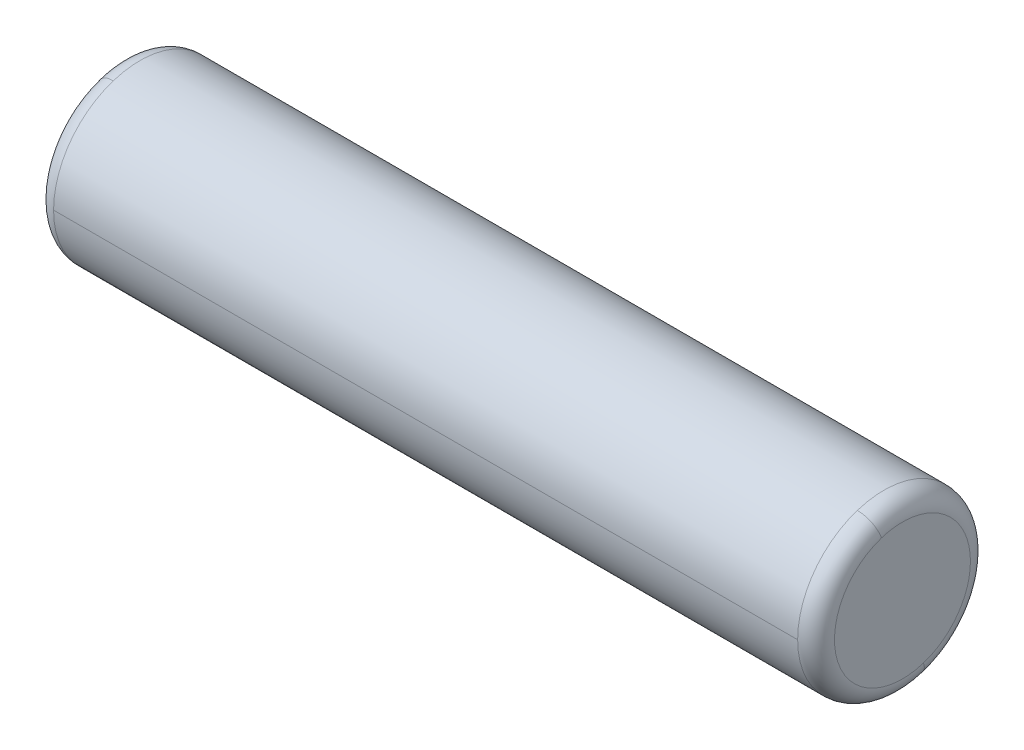
ISO-10303-21;
HEADER;
FILE_DESCRIPTION(('STEP AP214'),'2;1');
FILE_NAME('part.step','',(''),(''),'','','');
FILE_SCHEMA(('AUTOMOTIVE_DESIGN { 1 0 10303 214 1 1 1 1 }'));
ENDSEC;
DATA;
#1=APPLICATION_CONTEXT('core data for automotive mechanical design processes');
#2=APPLICATION_PROTOCOL_DEFINITION('international standard','automotive_design',2000,#1);
#3=PRODUCT_CONTEXT('',#1,'mechanical');
#4=PRODUCT('Part','Part','',(#3));
#5=PRODUCT_RELATED_PRODUCT_CATEGORY('part','',(#4));
#6=PRODUCT_DEFINITION_FORMATION('','',#4);
#7=PRODUCT_DEFINITION_CONTEXT('part definition',#1,'design');
#8=PRODUCT_DEFINITION('design','',#6,#7);
#9=PRODUCT_DEFINITION_SHAPE('','',#8);
#10=(LENGTH_UNIT() NAMED_UNIT(*) SI_UNIT(.MILLI.,.METRE.));
#11=(NAMED_UNIT(*) PLANE_ANGLE_UNIT() SI_UNIT($,.RADIAN.));
#12=(NAMED_UNIT(*) SI_UNIT($,.STERADIAN.) SOLID_ANGLE_UNIT());
#13=UNCERTAINTY_MEASURE_WITH_UNIT(LENGTH_MEASURE(1.E-05),#10,'distance_accuracy_value','');
#14=(GEOMETRIC_REPRESENTATION_CONTEXT(3) GLOBAL_UNCERTAINTY_ASSIGNED_CONTEXT((#13)) GLOBAL_UNIT_ASSIGNED_CONTEXT((#10,
#11,#12)) REPRESENTATION_CONTEXT('',''));
#15=CARTESIAN_POINT('',(0.,0.,0.));
#16=DIRECTION('',(0.,0.,1.));
#17=DIRECTION('',(1.,0.,0.));
#18=AXIS2_PLACEMENT_3D('',#15,#16,#17);
#19=CARTESIAN_POINT('',(4.35,13.75,0.));
#20=DIRECTION('',(1.,0.,0.));
#21=DIRECTION('',(0.,0.,-1.));
#22=AXIS2_PLACEMENT_3D('',#19,#20,#21);
#23=PLANE('',#22);
#24=CARTESIAN_POINT('',(4.35,14.6852055743572,0.303866711135478));
#25=CARTESIAN_POINT('',(4.35,14.6802338865014,0.319169097484086));
#26=CARTESIAN_POINT('',(4.35,14.6748859958781,0.334349217607592));
#27=CARTESIAN_POINT('',(4.35,14.6634520950515,0.364428888244151));
#28=CARTESIAN_POINT('',(4.35,14.6573660848481,0.379328438757202));
#29=CARTESIAN_POINT('',(4.35,14.6444702308162,0.408810933012599));
#30=CARTESIAN_POINT('',(4.35,14.6376603869877,0.423393876754943));
#31=CARTESIAN_POINT('',(4.35,14.6233333719047,0.452208064153467));
#32=CARTESIAN_POINT('',(4.35,14.6158162006503,0.466439307809646));
#33=CARTESIAN_POINT('',(4.35,14.6000926132601,0.494515800468052));
#34=CARTESIAN_POINT('',(4.35,14.5918861971243,0.50836104947028));
#35=CARTESIAN_POINT('',(4.35,14.5748038971756,0.535632201151139));
#36=CARTESIAN_POINT('',(4.35,14.5659280133628,0.549058103829769));
#37=CARTESIAN_POINT('',(4.35,14.5475281589046,0.575458217951613));
#38=CARTESIAN_POINT('',(4.35,14.5380041882593,0.588432429394827));
#39=CARTESIAN_POINT('',(4.35,14.5183311047346,0.613897905231353));
#40=CARTESIAN_POINT('',(4.35,14.5081819918552,0.626389169624665));
#41=CARTESIAN_POINT('',(4.35,14.4872830738254,0.650858658758497));
#42=CARTESIAN_POINT('',(4.35,14.4765332686748,0.662836883499016));
#43=CARTESIAN_POINT('',(4.35,14.454458863362,0.686251436748856));
#44=CARTESIAN_POINT('',(4.35,14.4431342631997,0.697687765258178));
#45=CARTESIAN_POINT('',(4.35,14.4199375498072,0.719990974924747));
#46=CARTESIAN_POINT('',(4.35,14.4080654365769,0.730857856081993));
#47=CARTESIAN_POINT('',(4.35,14.3838022980116,0.751995991776892));
#48=CARTESIAN_POINT('',(4.35,14.3714112726766,0.762267246314546));
#49=CARTESIAN_POINT('',(4.35,14.3461401609665,0.78218938441815));
#50=CARTESIAN_POINT('',(4.35,14.3332600745915,0.791840267984101));
#51=CARTESIAN_POINT('',(4.35,14.3070418700577,0.810498414320546));
#52=CARTESIAN_POINT('',(4.35,14.2937037518991,0.81950567709104));
#53=CARTESIAN_POINT('',(4.35,14.266601616493,0.836854882551594));
#54=CARTESIAN_POINT('',(4.35,14.2528375992455,0.845196825241654));
#55=CARTESIAN_POINT('',(4.35,14.2249168243851,0.861195294070737));
#56=CARTESIAN_POINT('',(4.35,14.210760066772,0.868851820209761));
#57=CARTESIAN_POINT('',(4.35,14.1820879160494,0.883461010694667));
#58=CARTESIAN_POINT('',(4.35,14.1675725229398,0.890413675040551));
#59=CARTESIAN_POINT('',(4.35,14.1382180700776,0.903598392361788));
#60=CARTESIAN_POINT('',(4.35,14.1233790103249,0.909830445337142));
#61=CARTESIAN_POINT('',(4.35,14.093412972771,0.921558926355838));
#62=CARTESIAN_POINT('',(4.35,14.0782859949699,0.92705535439918));
#63=CARTESIAN_POINT('',(4.35,14.0477805635337,0.937299344177268));
#64=CARTESIAN_POINT('',(4.35,14.0324021098986,0.942046905912013));
#65=CARTESIAN_POINT('',(4.35,14.0014307748363,0.950781725780848));
#66=CARTESIAN_POINT('',(4.35,13.985837893409,0.954768983914939));
#67=CARTESIAN_POINT('',(4.35,13.9544752673795,0.961973590928379));
#68=CARTESIAN_POINT('',(4.35,13.9387055227773,0.965190939807729));
#69=CARTESIAN_POINT('',(4.35,13.9070271610938,0.970847977436428));
#70=CARTESIAN_POINT('',(4.35,13.8911185440125,0.973287666185779));
#71=CARTESIAN_POINT('',(4.35,13.859200762623,0.977383506130593));
#72=CARTESIAN_POINT('',(4.35,13.8431915983147,0.979039657326057));
#73=CARTESIAN_POINT('',(4.35,13.8111112899501,0.981564432349806));
#74=CARTESIAN_POINT('',(4.35,13.7950401458939,0.982433056178091));
#75=CARTESIAN_POINT('',(4.35,13.7628745948271,0.983380683876598));
#76=CARTESIAN_POINT('',(4.35,13.7467801878166,0.983459687746819));
#77=CARTESIAN_POINT('',(4.35,13.7146068836775,0.982827885201955));
#78=CARTESIAN_POINT('',(4.35,13.6985279865489,0.98211707878687));
#79=CARTESIAN_POINT('',(4.35,13.6664244376451,0.979907368066306));
#80=CARTESIAN_POINT('',(4.35,13.65039978587,0.978408463760827));
#81=CARTESIAN_POINT('',(4.35,13.6184433324628,0.974626168251236));
#82=CARTESIAN_POINT('',(4.35,13.6025115308309,0.972342777047124));
#83=CARTESIAN_POINT('',(4.35,13.5707791588157,0.966997008629679));
#84=CARTESIAN_POINT('',(4.35,13.5549785884325,0.963934631416346));
#85=CARTESIAN_POINT('',(4.35,13.5235467438728,0.957038268515399));
#86=CARTESIAN_POINT('',(4.35,13.5079154696964,0.953204282827785));
#87=CARTESIAN_POINT('',(4.35,13.4768598746589,0.944773939385613));
#88=CARTESIAN_POINT('',(4.35,13.4614355537979,0.940177581631056));
#89=CARTESIAN_POINT('',(4.35,13.4308310239312,0.930233567083424));
#90=CARTESIAN_POINT('',(4.35,13.4156508149255,0.924885910290348));
#91=CARTESIAN_POINT('',(4.35,13.3855710792227,0.913452180639293));
#92=CARTESIAN_POINT('',(4.35,13.3706715525256,0.907366107781313));
#93=CARTESIAN_POINT('',(4.35,13.3411890757046,0.894470207883041));
#94=CARTESIAN_POINT('',(4.35,13.3266061255808,0.887660380842748));
#95=CARTESIAN_POINT('',(4.35,13.2977919335108,0.873333378049661));
#96=CARTESIAN_POINT('',(4.35,13.2835606915645,0.865816202296866));
#97=CARTESIAN_POINT('',(4.35,13.2554842001578,0.85009261161359));
#98=CARTESIAN_POINT('',(4.35,13.2416389506974,0.841886196683108));
#99=CARTESIAN_POINT('',(4.35,13.2143677986812,0.824803897616823));
#100=CARTESIAN_POINT('',(4.35,13.2009418961253,0.815928013481019));
#101=CARTESIAN_POINT('',(4.35,13.1745417820933,0.797528158786408));
#102=CARTESIAN_POINT('',(4.35,13.1615675706172,0.788004188227601));
#103=CARTESIAN_POINT('',(4.35,13.1361020947566,0.768331104766261));
#104=CARTESIAN_POINT('',(4.35,13.1236108303721,0.758181991863727));
#105=CARTESIAN_POINT('',(4.35,13.0991413412447,0.737283073816874));
#106=CARTESIAN_POINT('',(4.35,13.0871631165018,0.726533268672555));
#107=CARTESIAN_POINT('',(4.35,13.0637485632503,0.704458863364294));
#108=CARTESIAN_POINT('',(4.35,13.0523122347416,0.693134263200352));
#109=CARTESIAN_POINT('',(4.35,13.0300090250755,0.669937549806558));
#110=CARTESIAN_POINT('',(4.35,13.0191421439181,0.658065436576707));
#111=CARTESIAN_POINT('',(4.35,12.998004008223,0.63380229801174));
#112=CARTESIAN_POINT('',(4.35,12.9877327536854,0.621411272676625));
#113=CARTESIAN_POINT('',(4.35,12.9678106155819,0.596140160966488));
#114=CARTESIAN_POINT('',(4.35,12.9581597320159,0.583260074591466));
#115=CARTESIAN_POINT('',(4.35,12.9395015856794,0.557041870057756));
#116=CARTESIAN_POINT('',(4.35,12.930494322909,0.543703751899067));
#117=CARTESIAN_POINT('',(4.35,12.9131451174484,0.516601616492949));
#118=CARTESIAN_POINT('',(4.35,12.9048031747583,0.50283759924552));
#119=CARTESIAN_POINT('',(4.35,12.8888047059293,0.474916824385054));
#120=CARTESIAN_POINT('',(4.35,12.8811481797902,0.460760066772018));
#121=CARTESIAN_POINT('',(4.35,12.8665389893053,0.432087916049414));
#122=CARTESIAN_POINT('',(4.35,12.8595863249595,0.417572522939846));
#123=CARTESIAN_POINT('',(4.35,12.8464016076382,0.388218070077578));
#124=CARTESIAN_POINT('',(4.35,12.8401695546629,0.373379010324878));
#125=CARTESIAN_POINT('',(4.35,12.8284410736442,0.343412972771041));
#126=CARTESIAN_POINT('',(4.35,12.8229446456008,0.328285994969904));
#127=CARTESIAN_POINT('',(4.35,12.8127006558227,0.297780563533669));
#128=CARTESIAN_POINT('',(4.35,12.8079530940879,0.282402109898571));
#129=CARTESIAN_POINT('',(4.35,12.7992182742192,0.251430774836267));
#130=CARTESIAN_POINT('',(4.35,12.7952310160852,0.235837893409062));
#131=CARTESIAN_POINT('',(4.35,12.7880264090715,0.204475267379477));
#132=CARTESIAN_POINT('',(4.35,12.7848090601916,0.188705522777097));
#133=CARTESIAN_POINT('',(4.35,12.7791520225642,0.157027161093925));
#134=CARTESIAN_POINT('',(4.35,12.7767123338166,0.141118544013133));
#135=CARTESIAN_POINT('',(4.35,12.7726164938671,0.109200762622318));
#136=CARTESIAN_POINT('',(4.35,12.7709603426652,0.0931915983122949));
#137=CARTESIAN_POINT('',(4.35,12.768435567659,0.0611112899525205));
#138=CARTESIAN_POINT('',(4.35,12.7675669438546,0.0450401459027696));
#139=CARTESIAN_POINT('',(4.35,12.7666193160907,0.0128745948182438));
#140=CARTESIAN_POINT('',(4.35,12.7665403121311,-0.00321981221653088));
#141=CARTESIAN_POINT('',(4.35,12.7671721149201,-0.035393116289387));
#142=CARTESIAN_POINT('',(4.35,12.7678829216686,-0.0514720133274684));
#143=CARTESIAN_POINT('',(4.35,12.7700926314782,-0.0835755624785172));
#144=CARTESIAN_POINT('',(4.35,12.7715915345392,-0.0996002145914847));
#145=CARTESIAN_POINT('',(4.35,12.7753738334487,-0.131556667075682));
#146=CARTESIAN_POINT('',(4.35,12.7776572292972,-0.147488467446912));
#147=CARTESIAN_POINT('',(4.35,12.783002985026,-0.179220842906547));
#148=CARTESIAN_POINT('',(4.35,12.7860653449065,-0.195021417994952));
#149=CARTESIAN_POINT('',(4.35,12.7929617551618,-0.226453249699802));
#150=CARTESIAN_POINT('',(4.35,12.7967958055367,-0.242084506316247));
#151=CARTESIAN_POINT('',(4.35,12.8052259722499,-0.273140149328505));
#152=CARTESIAN_POINT('',(4.35,12.8098220885882,-0.288564535724317));
#153=CARTESIAN_POINT('',(4.35,12.8147944256428,-0.303866711135476));
#154=B_SPLINE_CURVE_WITH_KNOTS('',3,(#24,#25,#26,#27,#28,#29,#30,#31,#32,#33,#34,#35,#36,#37,
#38,#39,#40,#41,#42,#43,#44,#45,#46,#47,#48,#49,#50,#51,#52,#53,#54,#55,#56,#57,#58,#59,#60,#61,
#62,#63,#64,#65,#66,#67,#68,#69,#70,#71,#72,#73,#74,#75,#76,#77,#78,#79,#80,#81,#82,#83,#84,#85,
#86,#87,#88,#89,#90,#91,#92,#93,#94,#95,#96,#97,#98,#99,#100,#101,#102,#103,#104,#105,#106,#107,
#108,#109,#110,#111,#112,#113,#114,#115,#116,#117,#118,#119,#120,#121,#122,#123,#124,#125,#126,
#127,#128,#129,#130,#131,#132,#133,#134,#135,#136,#137,#138,#139,#140,#141,#142,#143,#144,#145,
#146,#147,#148,#149,#150,#151,#152,#153),.UNSPECIFIED.,.F.,.F.,(4,2,2,2,2,2,2,2,2,2,2,2,2,2,2,2,
2,2,2,2,2,2,2,2,2,2,2,2,2,2,2,2,2,2,2,2,2,2,2,2,2,2,2,2,2,2,2,2,2,2,2,2,2,2,2,2,2,2,2,2,2,2,2,2,
4),(0.,0.0482644160950784,0.0965288321901567,0.144793248285235,0.193057664380314,
0.241322080475392,0.289586496570471,0.337850912665548,0.386115328760627,0.434379744855706,
0.482644160950784,0.530908577045862,0.57917299314094,0.627437409236019,0.675701825331097,
0.723966241426175,0.772230657521253,0.820495073616331,0.868759489711409,0.917023905806488,
0.965288321901567,1.01355273799664,1.06181715409172,1.1100815701868,1.15834598628188,
1.20661040237696,1.25487481847204,1.30313923456711,1.35140365066219,1.39966806675727,
1.44793248285235,1.49619689894743,1.54446131504251,1.59272573113758,1.64099014723266,
1.68925456332774,1.73751897942282,1.7857833955179,1.83404781161298,1.88231222770806,
1.93057664380313,1.97884105989821,2.02710547599329,2.07536989208837,2.12363430818345,
2.17189872427852,2.2201631403736,2.26842755646868,2.31669197256376,2.36495638865884,
2.41322080475392,2.461485220849,2.50974963694407,2.55801405303915,2.60627846913423,
2.65454288522931,2.70280730132439,2.75107171741947,2.79933613351454,2.84760054960962,
2.8958649657047,2.94412938179978,2.99239379789486,3.04065821398994,3.08892263008501),.UNSPECIFIED.);
#155=CARTESIAN_POINT('',(4.35,14.6852055743572,0.303866711135475));
#156=VERTEX_POINT('',#155);
#157=CARTESIAN_POINT('',(4.35,12.8147944256428,-0.303866711135475));
#158=VERTEX_POINT('',#157);
#159=EDGE_CURVE('E11',#156,#158,#154,.T.);
#160=ORIENTED_EDGE('',*,*,#159,.F.);
#161=CARTESIAN_POINT('',(4.35,12.8147944256428,-0.303866711135478));
#162=CARTESIAN_POINT('',(4.35,12.8197661134986,-0.319169097484086));
#163=CARTESIAN_POINT('',(4.35,12.8251140041219,-0.334349217607592));
#164=CARTESIAN_POINT('',(4.35,12.8365479049485,-0.364428888244151));
#165=CARTESIAN_POINT('',(4.35,12.8426339151519,-0.379328438757202));
#166=CARTESIAN_POINT('',(4.35,12.8555297691838,-0.408810933012599));
#167=CARTESIAN_POINT('',(4.35,12.8623396130123,-0.423393876754943));
#168=CARTESIAN_POINT('',(4.35,12.8766666280953,-0.452208064153466));
#169=CARTESIAN_POINT('',(4.35,12.8841837993497,-0.466439307809645));
#170=CARTESIAN_POINT('',(4.35,12.8999073867399,-0.494515800468052));
#171=CARTESIAN_POINT('',(4.35,12.9081138028757,-0.508361049470279));
#172=CARTESIAN_POINT('',(4.35,12.9251961028244,-0.535632201151138));
#173=CARTESIAN_POINT('',(4.35,12.9340719866372,-0.549058103829769));
#174=CARTESIAN_POINT('',(4.35,12.9524718410954,-0.575458217951613));
#175=CARTESIAN_POINT('',(4.35,12.9619958117407,-0.588432429394826));
#176=CARTESIAN_POINT('',(4.35,12.9816688952654,-0.613897905231352));
#177=CARTESIAN_POINT('',(4.35,12.9918180081448,-0.626389169624665));
#178=CARTESIAN_POINT('',(4.35,13.0127169261746,-0.650858658758496));
#179=CARTESIAN_POINT('',(4.35,13.0234667313252,-0.662836883499016));
#180=CARTESIAN_POINT('',(4.35,13.045541136638,-0.686251436748856));
#181=CARTESIAN_POINT('',(4.35,13.0568657368003,-0.697687765258178));
#182=CARTESIAN_POINT('',(4.35,13.0800624501928,-0.719990974924746));
#183=CARTESIAN_POINT('',(4.35,13.0919345634231,-0.730857856081992));
#184=CARTESIAN_POINT('',(4.35,13.1161977019884,-0.751995991776892));
#185=CARTESIAN_POINT('',(4.35,13.1285887273234,-0.762267246314545));
#186=CARTESIAN_POINT('',(4.35,13.1538598390335,-0.782189384418149));
#187=CARTESIAN_POINT('',(4.35,13.1667399254085,-0.7918402679841));
#188=CARTESIAN_POINT('',(4.35,13.1929581299423,-0.810498414320545));
#189=CARTESIAN_POINT('',(4.35,13.2062962481009,-0.819505677091039));
#190=CARTESIAN_POINT('',(4.35,13.233398383507,-0.836854882551593));
#191=CARTESIAN_POINT('',(4.35,13.2471624007545,-0.845196825241654));
#192=CARTESIAN_POINT('',(4.35,13.2750831756149,-0.861195294070737));
#193=CARTESIAN_POINT('',(4.35,13.289239933228,-0.86885182020976));
#194=CARTESIAN_POINT('',(4.35,13.3179120839506,-0.883461010694667));
#195=CARTESIAN_POINT('',(4.35,13.3324274770602,-0.890413675040551));
#196=CARTESIAN_POINT('',(4.35,13.3617819299224,-0.903598392361788));
#197=CARTESIAN_POINT('',(4.35,13.3766209896751,-0.909830445337141));
#198=CARTESIAN_POINT('',(4.35,13.406587027229,-0.921558926355838));
#199=CARTESIAN_POINT('',(4.35,13.4217140050301,-0.92705535439918));
#200=CARTESIAN_POINT('',(4.35,13.4522194364663,-0.937299344177268));
#201=CARTESIAN_POINT('',(4.35,13.4675978901014,-0.942046905912012));
#202=CARTESIAN_POINT('',(4.35,13.4985692251637,-0.950781725780848));
#203=CARTESIAN_POINT('',(4.35,13.514162106591,-0.954768983914939));
#204=CARTESIAN_POINT('',(4.35,13.5455247326205,-0.961973590928379));
#205=CARTESIAN_POINT('',(4.35,13.5612944772227,-0.965190939807728));
#206=CARTESIAN_POINT('',(4.35,13.5929728389062,-0.970847977436428));
#207=CARTESIAN_POINT('',(4.35,13.6088814559875,-0.973287666185779));
#208=CARTESIAN_POINT('',(4.35,13.640799237377,-0.977383506130593));
#209=CARTESIAN_POINT('',(4.35,13.6568084016853,-0.979039657326057));
#210=CARTESIAN_POINT('',(4.35,13.6888887100499,-0.981564432349806));
#211=CARTESIAN_POINT('',(4.35,13.7049598541061,-0.982433056178091));
#212=CARTESIAN_POINT('',(4.35,13.7371254051729,-0.983380683876598));
#213=CARTESIAN_POINT('',(4.35,13.7532198121834,-0.983459687746819));
#214=CARTESIAN_POINT('',(4.35,13.7853931163225,-0.982827885201956));
#215=CARTESIAN_POINT('',(4.35,13.8014720134511,-0.98211707878687));
#216=CARTESIAN_POINT('',(4.35,13.8335755623549,-0.979907368066306));
#217=CARTESIAN_POINT('',(4.35,13.84960021413,-0.978408463760827));
#218=CARTESIAN_POINT('',(4.35,13.8815566675371,-0.974626168251236));
#219=CARTESIAN_POINT('',(4.35,13.8974884691691,-0.972342777047125));
#220=CARTESIAN_POINT('',(4.35,13.9292208411843,-0.96699700862968));
#221=CARTESIAN_POINT('',(4.35,13.9450214115675,-0.963934631416347));
#222=CARTESIAN_POINT('',(4.35,13.9764532561272,-0.957038268515399));
#223=CARTESIAN_POINT('',(4.35,13.9920845303036,-0.953204282827785));
#224=CARTESIAN_POINT('',(4.35,14.0231401253411,-0.944773939385614));
#225=CARTESIAN_POINT('',(4.35,14.0385644462021,-0.940177581631057));
#226=CARTESIAN_POINT('',(4.35,14.0691689760688,-0.930233567083424));
#227=CARTESIAN_POINT('',(4.35,14.0843491850745,-0.924885910290349));
#228=CARTESIAN_POINT('',(4.35,14.1144289207773,-0.913452180639293));
#229=CARTESIAN_POINT('',(4.35,14.1293284474744,-0.907366107781313));
#230=CARTESIAN_POINT('',(4.35,14.1588109242954,-0.894470207883041));
#231=CARTESIAN_POINT('',(4.35,14.1733938744192,-0.887660380842749));
#232=CARTESIAN_POINT('',(4.35,14.2022080664892,-0.873333378049661));
#233=CARTESIAN_POINT('',(4.35,14.2164393084355,-0.865816202296867));
#234=CARTESIAN_POINT('',(4.35,14.2445157998422,-0.850092611613591));
#235=CARTESIAN_POINT('',(4.35,14.2583610493026,-0.841886196683109));
#236=CARTESIAN_POINT('',(4.35,14.2856322013188,-0.824803897616824));
#237=CARTESIAN_POINT('',(4.35,14.2990581038747,-0.815928013481021));
#238=CARTESIAN_POINT('',(4.35,14.3254582179067,-0.797528158786409));
#239=CARTESIAN_POINT('',(4.35,14.3384324293828,-0.788004188227602));
#240=CARTESIAN_POINT('',(4.35,14.3638979052434,-0.768331104766262));
#241=CARTESIAN_POINT('',(4.35,14.3763891696279,-0.758181991863728));
#242=CARTESIAN_POINT('',(4.35,14.4008586587553,-0.737283073816876));
#243=CARTESIAN_POINT('',(4.35,14.4128368834981,-0.726533268672556));
#244=CARTESIAN_POINT('',(4.35,14.4362514367497,-0.704458863364295));
#245=CARTESIAN_POINT('',(4.35,14.4476877652584,-0.693134263200353));
#246=CARTESIAN_POINT('',(4.35,14.4699909749245,-0.66993754980656));
#247=CARTESIAN_POINT('',(4.35,14.4808578560819,-0.658065436576709));
#248=CARTESIAN_POINT('',(4.35,14.501995991777,-0.633802298011742));
#249=CARTESIAN_POINT('',(4.35,14.5122672463146,-0.621411272676627));
#250=CARTESIAN_POINT('',(4.35,14.5321893844181,-0.59614016096649));
#251=CARTESIAN_POINT('',(4.35,14.5418402679841,-0.583260074591468));
#252=CARTESIAN_POINT('',(4.35,14.5604984143205,-0.557041870057758));
#253=CARTESIAN_POINT('',(4.35,14.569505677091,-0.54370375189907));
#254=CARTESIAN_POINT('',(4.35,14.5868548825516,-0.516601616492952));
#255=CARTESIAN_POINT('',(4.35,14.5951968252417,-0.502837599245522));
#256=CARTESIAN_POINT('',(4.35,14.6111952940707,-0.474916824385056));
#257=CARTESIAN_POINT('',(4.35,14.6188518202098,-0.46076006677202));
#258=CARTESIAN_POINT('',(4.35,14.6334610106947,-0.432087916049416));
#259=CARTESIAN_POINT('',(4.35,14.6404136750405,-0.417572522939848));
#260=CARTESIAN_POINT('',(4.35,14.6535983923618,-0.388218070077581));
#261=CARTESIAN_POINT('',(4.35,14.6598304453371,-0.373379010324881));
#262=CARTESIAN_POINT('',(4.35,14.6715589263558,-0.343412972771044));
#263=CARTESIAN_POINT('',(4.35,14.6770553543992,-0.328285994969907));
#264=CARTESIAN_POINT('',(4.35,14.6872993441773,-0.297780563533671));
#265=CARTESIAN_POINT('',(4.35,14.6920469059121,-0.282402109898573));
#266=CARTESIAN_POINT('',(4.35,14.7007817257808,-0.25143077483627));
#267=CARTESIAN_POINT('',(4.35,14.7047689839148,-0.235837893409065));
#268=CARTESIAN_POINT('',(4.35,14.7119735909285,-0.204475267379479));
#269=CARTESIAN_POINT('',(4.35,14.7151909398084,-0.188705522777099));
#270=CARTESIAN_POINT('',(4.35,14.7208479774358,-0.157027161093928));
#271=CARTESIAN_POINT('',(4.35,14.7232876661834,-0.141118544013136));
#272=CARTESIAN_POINT('',(4.35,14.7273835061329,-0.109200762622322));
#273=CARTESIAN_POINT('',(4.35,14.7290396573348,-0.0931915983122985));
#274=CARTESIAN_POINT('',(4.35,14.731564432341,-0.0611112899525242));
#275=CARTESIAN_POINT('',(4.35,14.7324330561454,-0.0450401459027731));
#276=CARTESIAN_POINT('',(4.35,14.7333806839093,-0.0128745948182474));
#277=CARTESIAN_POINT('',(4.35,14.7334596878689,0.00321981221652725));
#278=CARTESIAN_POINT('',(4.35,14.7328278850799,0.0353931162893833));
#279=CARTESIAN_POINT('',(4.35,14.7321170783314,0.0514720133274647));
#280=CARTESIAN_POINT('',(4.35,14.7299073685218,0.0835755624785136));
#281=CARTESIAN_POINT('',(4.35,14.7284084654608,0.0996002145914811));
#282=CARTESIAN_POINT('',(4.35,14.7246261665513,0.131556667075679));
#283=CARTESIAN_POINT('',(4.35,14.7223427707028,0.147488467446909));
#284=CARTESIAN_POINT('',(4.35,14.716997014974,0.179220842906544));
#285=CARTESIAN_POINT('',(4.35,14.7139346550935,0.195021417994949));
#286=CARTESIAN_POINT('',(4.35,14.7070382448382,0.226453249699799));
#287=CARTESIAN_POINT('',(4.35,14.7032041944633,0.242084506316244));
#288=CARTESIAN_POINT('',(4.35,14.6947740277501,0.273140149328501));
#289=CARTESIAN_POINT('',(4.35,14.6901779114118,0.288564535724313));
#290=CARTESIAN_POINT('',(4.35,14.6852055743572,0.303866711135472));
#291=B_SPLINE_CURVE_WITH_KNOTS('',3,(#161,#162,#163,#164,#165,#166,#167,#168,#169,#170,#171,
#172,#173,#174,#175,#176,#177,#178,#179,#180,#181,#182,#183,#184,#185,#186,#187,#188,#189,#190,
#191,#192,#193,#194,#195,#196,#197,#198,#199,#200,#201,#202,#203,#204,#205,#206,#207,#208,#209,
#210,#211,#212,#213,#214,#215,#216,#217,#218,#219,#220,#221,#222,#223,#224,#225,#226,#227,#228,
#229,#230,#231,#232,#233,#234,#235,#236,#237,#238,#239,#240,#241,#242,#243,#244,#245,#246,#247,
#248,#249,#250,#251,#252,#253,#254,#255,#256,#257,#258,#259,#260,#261,#262,#263,#264,#265,#266,
#267,#268,#269,#270,#271,#272,#273,#274,#275,#276,#277,#278,#279,#280,#281,#282,#283,#284,#285,
#286,#287,#288,#289,#290),.UNSPECIFIED.,.F.,.F.,(4,2,2,2,2,2,2,2,2,2,2,2,2,2,2,2,2,2,2,2,2,2,2,
2,2,2,2,2,2,2,2,2,2,2,2,2,2,2,2,2,2,2,2,2,2,2,2,2,2,2,2,2,2,2,2,2,2,2,2,2,2,2,2,2,4),(0.,
0.0482644160950784,0.0965288321901567,0.144793248285235,0.193057664380313,0.241322080475392,
0.289586496570469,0.337850912665548,0.386115328760627,0.434379744855704,0.482644160950783,
0.530908577045861,0.579172993140939,0.627437409236017,0.675701825331096,0.723966241426175,
0.772230657521253,0.820495073616331,0.868759489711409,0.917023905806487,0.965288321901565,
1.01355273799664,1.06181715409172,1.1100815701868,1.15834598628188,1.20661040237696,
1.25487481847204,1.30313923456711,1.35140365066219,1.39966806675727,1.44793248285235,
1.49619689894743,1.54446131504251,1.59272573113758,1.64099014723266,1.68925456332774,
1.73751897942282,1.7857833955179,1.83404781161297,1.88231222770805,1.93057664380313,
1.97884105989821,2.02710547599329,2.07536989208837,2.12363430818345,2.17189872427852,
2.2201631403736,2.26842755646868,2.31669197256376,2.36495638865884,2.41322080475391,
2.46148522084899,2.50974963694407,2.55801405303915,2.60627846913423,2.65454288522931,
2.70280730132438,2.75107171741946,2.79933613351454,2.84760054960962,2.8958649657047,
2.94412938179978,2.99239379789485,3.04065821398993,3.08892263008501),.UNSPECIFIED.);
#292=EDGE_CURVE('E26',#158,#156,#291,.T.);
#293=ORIENTED_EDGE('',*,*,#292,.F.);
#294=EDGE_LOOP('',(#160,#293));
#295=FACE_BOUND('',#294,.T.);
#296=ADVANCED_FACE('F17',(#295),#23,.F.);
#297=CARTESIAN_POINT('',(4.61666666666631,13.75,0.));
#298=DIRECTION('',(1.,0.,0.));
#299=DIRECTION('',(0.,-0.309016994374947,0.951056516295154));
#300=AXIS2_PLACEMENT_3D('',#297,#298,#299);
#301=TOROIDAL_SURFACE('',#300,0.98333333333369,0.266666666666311);
#302=CARTESIAN_POINT('',(4.61666666666631,12.8147944256428,-0.303866711135475));
#303=DIRECTION('',(0.,0.309016994374949,-0.951056516295153));
#304=DIRECTION('',(1.46216372343329E-12,-0.951056516295153,-0.309016994374949));
#305=AXIS2_PLACEMENT_3D('',#302,#303,#304);
#306=CIRCLE('',#305,0.26666666666631);
#307=CARTESIAN_POINT('',(4.6166666666667,12.5611793546311,-0.386271242968684));
#308=VERTEX_POINT('',#307);
#309=EDGE_CURVE('E139',#308,#158,#306,.T.);
#310=ORIENTED_EDGE('',*,*,#309,.T.);
#311=ORIENTED_EDGE('',*,*,#292,.T.);
#312=CARTESIAN_POINT('',(4.61666666666631,14.6852055743572,0.303866711135475));
#313=DIRECTION('',(0.,-0.309016994374949,0.951056516295153));
#314=DIRECTION('',(1.46216372343329E-12,0.951056516295153,0.309016994374949));
#315=AXIS2_PLACEMENT_3D('',#312,#313,#314);
#316=CIRCLE('',#315,0.26666666666631);
#317=CARTESIAN_POINT('',(4.6166666666667,14.9388206453689,0.386271242968684));
#318=VERTEX_POINT('',#317);
#319=EDGE_CURVE('E135',#318,#156,#316,.T.);
#320=ORIENTED_EDGE('',*,*,#319,.F.);
#321=CARTESIAN_POINT('',(4.6166666666667,13.75,0.));
#322=DIRECTION('',(1.,0.,0.));
#323=DIRECTION('',(0.,0.,-1.));
#324=AXIS2_PLACEMENT_3D('',#321,#322,#323);
#325=CIRCLE('',#324,1.25);
#326=CARTESIAN_POINT('',(4.6166666666667,13.75,-1.25));
#327=VERTEX_POINT('',#326);
#328=EDGE_CURVE('E130',#327,#318,#325,.T.);
#329=ORIENTED_EDGE('',*,*,#328,.F.);
#330=CARTESIAN_POINT('',(4.6166666666667,13.75,0.));
#331=DIRECTION('',(1.,0.,0.));
#332=DIRECTION('',(0.,0.,-1.));
#333=AXIS2_PLACEMENT_3D('',#330,#331,#332);
#334=CIRCLE('',#333,1.25);
#335=EDGE_CURVE('E125',#308,#327,#334,.T.);
#336=ORIENTED_EDGE('',*,*,#335,.F.);
#337=EDGE_LOOP('',(#310,#311,#320,#329,#336));
#338=FACE_BOUND('',#337,.T.);
#339=ADVANCED_FACE('F146',(#338),#301,.T.);
#340=CARTESIAN_POINT('',(15.65,13.75,0.));
#341=DIRECTION('',(1.,0.,0.));
#342=DIRECTION('',(0.,1.,0.));
#343=AXIS2_PLACEMENT_3D('',#340,#341,#342);
#344=CYLINDRICAL_SURFACE('',#343,1.25);
#345=DIRECTION('',(1.,0.,0.));
#346=VECTOR('',#345,1.);
#347=CARTESIAN_POINT('',(4.6166666666667,13.75,1.25));
#348=LINE('',#347,#346);
#349=CARTESIAN_POINT('',(4.6166666666667,13.75,1.25));
#350=VERTEX_POINT('',#349);
#351=CARTESIAN_POINT('',(15.383333333333,13.75,1.25));
#352=VERTEX_POINT('',#351);
#353=EDGE_CURVE('E92',#350,#352,#348,.T.);
#354=ORIENTED_EDGE('',*,*,#353,.F.);
#355=CARTESIAN_POINT('',(4.6166666666667,13.75,0.));
#356=DIRECTION('',(1.,0.,0.));
#357=DIRECTION('',(0.,0.,-1.));
#358=AXIS2_PLACEMENT_3D('',#355,#356,#357);
#359=CIRCLE('',#358,1.25);
#360=EDGE_CURVE('E117',#350,#308,#359,.T.);
#361=ORIENTED_EDGE('',*,*,#360,.T.);
#362=ORIENTED_EDGE('',*,*,#335,.T.);
#363=DIRECTION('',(1.,0.,0.));
#364=VECTOR('',#363,1.);
#365=CARTESIAN_POINT('',(4.6166666666667,13.75,-1.25));
#366=LINE('',#365,#364);
#367=CARTESIAN_POINT('',(15.383333333333,13.75,-1.25));
#368=VERTEX_POINT('',#367);
#369=EDGE_CURVE('E113',#327,#368,#366,.T.);
#370=ORIENTED_EDGE('',*,*,#369,.T.);
#371=CARTESIAN_POINT('',(15.383333333333,13.75,0.));
#372=DIRECTION('',(1.,0.,0.));
#373=DIRECTION('',(0.,0.,-1.));
#374=AXIS2_PLACEMENT_3D('',#371,#372,#373);
#375=CIRCLE('',#374,1.25);
#376=CARTESIAN_POINT('',(15.383333333333,12.5611793546311,-0.386271242968684));
#377=VERTEX_POINT('',#376);
#378=EDGE_CURVE('E84',#377,#368,#375,.T.);
#379=ORIENTED_EDGE('',*,*,#378,.F.);
#380=CARTESIAN_POINT('',(15.383333333333,13.75,0.));
#381=DIRECTION('',(1.,0.,0.));
#382=DIRECTION('',(0.,0.,-1.));
#383=AXIS2_PLACEMENT_3D('',#380,#381,#382);
#384=CIRCLE('',#383,1.25);
#385=EDGE_CURVE('E106',#352,#377,#384,.T.);
#386=ORIENTED_EDGE('',*,*,#385,.F.);
#387=EDGE_LOOP('',(#354,#361,#362,#370,#379,#386));
#388=FACE_BOUND('',#387,.T.);
#389=ADVANCED_FACE('F155',(#388),#344,.T.);
#390=CARTESIAN_POINT('',(15.3833333333342,13.75,0.));
#391=DIRECTION('',(1.,0.,0.));
#392=DIRECTION('',(0.,0.309016994374947,-0.951056516295154));
#393=AXIS2_PLACEMENT_3D('',#390,#391,#392);
#394=TOROIDAL_SURFACE('',#393,0.9833333333342,0.266666666665799);
#395=CARTESIAN_POINT('',(15.3833333333342,12.8147944256423,-0.303866711135633));
#396=DIRECTION('',(0.,0.309016994374947,-0.951056516295154));
#397=DIRECTION('',(1.,0.,0.));
#398=AXIS2_PLACEMENT_3D('',#395,#396,#397);
#399=CIRCLE('',#398,0.266666666665799);
#400=CARTESIAN_POINT('',(15.65,12.8147944256423,-0.303866711135633));
#401=VERTEX_POINT('',#400);
#402=EDGE_CURVE('E102',#401,#377,#399,.T.);
#403=ORIENTED_EDGE('',*,*,#402,.F.);
#404=CARTESIAN_POINT('',(15.65,13.75,0.));
#405=DIRECTION('',(1.,0.,0.));
#406=DIRECTION('',(0.,0.,-1.));
#407=AXIS2_PLACEMENT_3D('',#404,#405,#406);
#408=CIRCLE('',#407,0.983333333333001);
#409=CARTESIAN_POINT('',(15.65,14.6852055743577,0.303866711135633));
#410=VERTEX_POINT('',#409);
#411=EDGE_CURVE('E74',#410,#401,#408,.T.);
#412=ORIENTED_EDGE('',*,*,#411,.F.);
#413=CARTESIAN_POINT('',(15.3833333333342,14.6852055743577,0.303866711135633));
#414=DIRECTION('',(0.,-0.309016994374947,0.951056516295154));
#415=DIRECTION('',(1.,0.,0.));
#416=AXIS2_PLACEMENT_3D('',#413,#414,#415);
#417=CIRCLE('',#416,0.266666666665799);
#418=CARTESIAN_POINT('',(15.383333333333,14.9388206453689,0.386271242968684));
#419=VERTEX_POINT('',#418);
#420=EDGE_CURVE('E67',#410,#419,#417,.T.);
#421=ORIENTED_EDGE('',*,*,#420,.T.);
#422=CARTESIAN_POINT('',(15.383333333333,13.75,0.));
#423=DIRECTION('',(1.,0.,0.));
#424=DIRECTION('',(0.,0.,-1.));
#425=AXIS2_PLACEMENT_3D('',#422,#423,#424);
#426=CIRCLE('',#425,1.25);
#427=EDGE_CURVE('E72',#419,#352,#426,.T.);
#428=ORIENTED_EDGE('',*,*,#427,.T.);
#429=ORIENTED_EDGE('',*,*,#385,.T.);
#430=EDGE_LOOP('',(#403,#412,#421,#428,#429));
#431=FACE_BOUND('',#430,.T.);
#432=ADVANCED_FACE('F69',(#431),#394,.T.);
#433=CARTESIAN_POINT('',(15.65,13.75,0.));
#434=DIRECTION('',(1.,0.,0.));
#435=DIRECTION('',(0.,-1.,0.));
#436=AXIS2_PLACEMENT_3D('',#433,#434,#435);
#437=CYLINDRICAL_SURFACE('',#436,1.25);
#438=ORIENTED_EDGE('',*,*,#353,.T.);
#439=ORIENTED_EDGE('',*,*,#427,.F.);
#440=CARTESIAN_POINT('',(15.383333333333,13.75,0.));
#441=DIRECTION('',(1.,0.,0.));
#442=DIRECTION('',(0.,0.,-1.));
#443=AXIS2_PLACEMENT_3D('',#440,#441,#442);
#444=CIRCLE('',#443,1.25);
#445=EDGE_CURVE('E81',#368,#419,#444,.T.);
#446=ORIENTED_EDGE('',*,*,#445,.F.);
#447=ORIENTED_EDGE('',*,*,#369,.F.);
#448=ORIENTED_EDGE('',*,*,#328,.T.);
#449=CARTESIAN_POINT('',(4.6166666666667,13.75,0.));
#450=DIRECTION('',(1.,0.,0.));
#451=DIRECTION('',(0.,0.,-1.));
#452=AXIS2_PLACEMENT_3D('',#449,#450,#451);
#453=CIRCLE('',#452,1.25);
#454=EDGE_CURVE('E87',#318,#350,#453,.T.);
#455=ORIENTED_EDGE('',*,*,#454,.T.);
#456=EDGE_LOOP('',(#438,#439,#446,#447,#448,#455));
#457=FACE_BOUND('',#456,.T.);
#458=ADVANCED_FACE('F90',(#457),#437,.T.);
#459=CARTESIAN_POINT('',(4.61666666666631,13.75,0.));
#460=DIRECTION('',(1.,0.,0.));
#461=DIRECTION('',(0.,0.309016994374947,-0.951056516295154));
#462=AXIS2_PLACEMENT_3D('',#459,#460,#461);
#463=TOROIDAL_SURFACE('',#462,0.98333333333369,0.266666666666311);
#464=ORIENTED_EDGE('',*,*,#309,.F.);
#465=ORIENTED_EDGE('',*,*,#360,.F.);
#466=ORIENTED_EDGE('',*,*,#454,.F.);
#467=ORIENTED_EDGE('',*,*,#319,.T.);
#468=ORIENTED_EDGE('',*,*,#159,.T.);
#469=EDGE_LOOP('',(#464,#465,#466,#467,#468));
#470=FACE_BOUND('',#469,.T.);
#471=ADVANCED_FACE('F164',(#470),#463,.T.);
#472=CARTESIAN_POINT('',(15.3833333333342,13.75,0.));
#473=DIRECTION('',(1.,0.,0.));
#474=DIRECTION('',(0.,-0.309016994374947,0.951056516295154));
#475=AXIS2_PLACEMENT_3D('',#472,#473,#474);
#476=TOROIDAL_SURFACE('',#475,0.9833333333342,0.266666666665799);
#477=ORIENTED_EDGE('',*,*,#402,.T.);
#478=ORIENTED_EDGE('',*,*,#378,.T.);
#479=ORIENTED_EDGE('',*,*,#445,.T.);
#480=ORIENTED_EDGE('',*,*,#420,.F.);
#481=CARTESIAN_POINT('',(15.65,12.8147944256434,-0.303866711135262));
#482=CARTESIAN_POINT('',(15.65,12.9103464467537,-0.597539557801668));
#483=CARTESIAN_POINT('',(15.65,13.1207084254313,-0.854528990321975));
#484=CARTESIAN_POINT('',(15.65,13.4287389050843,-1.0110786917653));
#485=CARTESIAN_POINT('',(15.65,14.0912625550558,-1.05029814754964));
#486=CARTESIAN_POINT('',(15.65,14.6042028293451,-0.629147310561747));
#487=CARTESIAN_POINT('',(15.65,14.7613871164106,-0.321440168433177));
#488=CARTESIAN_POINT('',(15.65,14.7805189337007,0.0101163185602783));
#489=CARTESIAN_POINT('',(15.65,14.6852055743566,0.303866711135262));
#490=B_SPLINE_CURVE_WITH_KNOTS('',5,(#481,#482,#483,#484,#485,#486,#487,#488,#489),
.UNSPECIFIED.,.F.,.F.,(6,3,6),(0.,1.5707963267949,3.14159265358979),.UNSPECIFIED.);
#491=EDGE_CURVE('E185',#401,#410,#490,.T.);
#492=ORIENTED_EDGE('',*,*,#491,.F.);
#493=EDGE_LOOP('',(#477,#478,#479,#480,#492));
#494=FACE_BOUND('',#493,.T.);
#495=ADVANCED_FACE('F83',(#494),#476,.T.);
#496=CARTESIAN_POINT('',(15.65,14.733333333333,0.));
#497=DIRECTION('',(-1.,0.,0.));
#498=DIRECTION('',(0.,0.,1.));
#499=AXIS2_PLACEMENT_3D('',#496,#497,#498);
#500=PLANE('',#499);
#501=ORIENTED_EDGE('',*,*,#491,.T.);
#502=ORIENTED_EDGE('',*,*,#411,.T.);
#503=EDGE_LOOP('',(#501,#502));
#504=FACE_BOUND('',#503,.T.);
#505=ADVANCED_FACE('F191',(#504),#500,.F.);
#506=CLOSED_SHELL('',(#296,#339,#389,#432,#458,#471,#495,#505));
#507=MANIFOLD_SOLID_BREP('B1',#506);
#508=ADVANCED_BREP_SHAPE_REPRESENTATION('',(#18,#507),#14);
#509=SHAPE_DEFINITION_REPRESENTATION(#9,#508);
ENDSEC;
END-ISO-10303-21;
